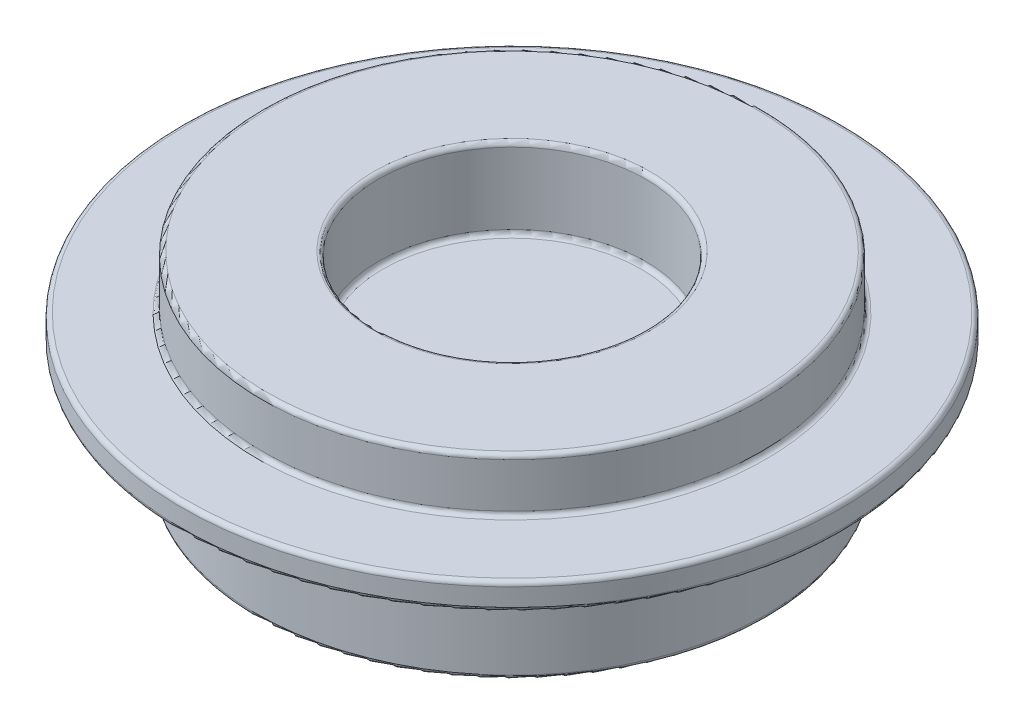
ISO-10303-21;
HEADER;
FILE_DESCRIPTION(('STEP AP214'),'2;1');
FILE_NAME('part.step','',(''),(''),'','','');
FILE_SCHEMA(('AUTOMOTIVE_DESIGN { 1 0 10303 214 1 1 1 1 }'));
ENDSEC;
DATA;
#1=APPLICATION_CONTEXT('core data for automotive mechanical design processes');
#2=APPLICATION_PROTOCOL_DEFINITION('international standard','automotive_design',2000,#1);
#3=PRODUCT_CONTEXT('',#1,'mechanical');
#4=PRODUCT('Part','Part','',(#3));
#5=PRODUCT_RELATED_PRODUCT_CATEGORY('part','',(#4));
#6=PRODUCT_DEFINITION_FORMATION('','',#4);
#7=PRODUCT_DEFINITION_CONTEXT('part definition',#1,'design');
#8=PRODUCT_DEFINITION('design','',#6,#7);
#9=PRODUCT_DEFINITION_SHAPE('','',#8);
#10=(LENGTH_UNIT() NAMED_UNIT(*) SI_UNIT(.MILLI.,.METRE.));
#11=(NAMED_UNIT(*) PLANE_ANGLE_UNIT() SI_UNIT($,.RADIAN.));
#12=(NAMED_UNIT(*) SI_UNIT($,.STERADIAN.) SOLID_ANGLE_UNIT());
#13=UNCERTAINTY_MEASURE_WITH_UNIT(LENGTH_MEASURE(1.E-05),#10,'distance_accuracy_value','');
#14=(GEOMETRIC_REPRESENTATION_CONTEXT(3) GLOBAL_UNCERTAINTY_ASSIGNED_CONTEXT((#13)) GLOBAL_UNIT_ASSIGNED_CONTEXT((#10,
#11,#12)) REPRESENTATION_CONTEXT('',''));
#15=CARTESIAN_POINT('',(0.,0.,0.));
#16=DIRECTION('',(0.,0.,1.));
#17=DIRECTION('',(1.,0.,0.));
#18=AXIS2_PLACEMENT_3D('',#15,#16,#17);
#19=CARTESIAN_POINT('',(-14.3125,0.,0.));
#20=DIRECTION('',(0.,-1.,0.));
#21=DIRECTION('',(1.,0.,0.));
#22=AXIS2_PLACEMENT_3D('',#19,#20,#21);
#23=PLANE('',#22);
#24=CARTESIAN_POINT('',(0.,0.,0.));
#25=DIRECTION('',(0.,-1.,0.));
#26=DIRECTION('',(1.,0.,0.));
#27=AXIS2_PLACEMENT_3D('',#24,#25,#26);
#28=CIRCLE('',#27,14.0625);
#29=CARTESIAN_POINT('',(14.0625,0.,0.));
#30=VERTEX_POINT('',#29);
#31=EDGE_CURVE('E10',#30,#30,#28,.T.);
#32=ORIENTED_EDGE('',*,*,#31,.T.);
#33=EDGE_LOOP('',(#32));
#34=FACE_BOUND('',#33,.T.);
#35=ADVANCED_FACE('F40',(#34),#23,.T.);
#36=CARTESIAN_POINT('',(0.,6.25,0.));
#37=DIRECTION('',(0.,1.,0.));
#38=DIRECTION('',(-1.,0.,0.));
#39=AXIS2_PLACEMENT_3D('',#36,#37,#38);
#40=PLANE('',#39);
#41=CARTESIAN_POINT('',(0.,6.25,0.));
#42=DIRECTION('',(0.,1.,0.));
#43=DIRECTION('',(-1.,0.,0.));
#44=AXIS2_PLACEMENT_3D('',#41,#42,#43);
#45=CIRCLE('',#44,7.25);
#46=CARTESIAN_POINT('',(-7.25,6.25,0.));
#47=VERTEX_POINT('',#46);
#48=EDGE_CURVE('E84',#47,#47,#45,.T.);
#49=ORIENTED_EDGE('',*,*,#48,.T.);
#50=EDGE_LOOP('',(#49));
#51=FACE_BOUND('',#50,.T.);
#52=ADVANCED_FACE('F137',(#51),#40,.T.);
#53=CARTESIAN_POINT('',(0.,17.96875,0.));
#54=DIRECTION('',(0.,1.,0.));
#55=DIRECTION('',(-1.,0.,0.));
#56=AXIS2_PLACEMENT_3D('',#53,#54,#55);
#57=CYLINDRICAL_SURFACE('',#56,7.5);
#58=CARTESIAN_POINT('',(0.,6.5,0.));
#59=DIRECTION('',(0.,1.,0.));
#60=DIRECTION('',(-1.,0.,0.));
#61=AXIS2_PLACEMENT_3D('',#58,#59,#60);
#62=CIRCLE('',#61,7.5);
#63=CARTESIAN_POINT('',(-7.5,6.5,0.));
#64=VERTEX_POINT('',#63);
#65=EDGE_CURVE('E76',#64,#64,#62,.F.);
#66=ORIENTED_EDGE('',*,*,#65,.T.);
#67=EDGE_LOOP('',(#66));
#68=FACE_BOUND('',#67,.T.);
#69=CARTESIAN_POINT('',(0.,10.5,0.));
#70=DIRECTION('',(0.,1.,0.));
#71=DIRECTION('',(-1.,0.,0.));
#72=AXIS2_PLACEMENT_3D('',#69,#70,#71);
#73=CIRCLE('',#72,7.5);
#74=CARTESIAN_POINT('',(-7.5,10.5,0.));
#75=VERTEX_POINT('',#74);
#76=EDGE_CURVE('E80',#75,#75,#73,.T.);
#77=ORIENTED_EDGE('',*,*,#76,.T.);
#78=EDGE_LOOP('',(#77));
#79=FACE_BOUND('',#78,.T.);
#80=ADVANCED_FACE('F133',(#68,#79),#57,.F.);
#81=CARTESIAN_POINT('',(-7.5,10.75,0.));
#82=DIRECTION('',(0.,1.,0.));
#83=DIRECTION('',(-1.,0.,0.));
#84=AXIS2_PLACEMENT_3D('',#81,#82,#83);
#85=PLANE('',#84);
#86=CARTESIAN_POINT('',(0.,10.75,0.));
#87=DIRECTION('',(0.,1.,0.));
#88=DIRECTION('',(-1.,0.,0.));
#89=AXIS2_PLACEMENT_3D('',#86,#87,#88);
#90=CIRCLE('',#89,7.75);
#91=CARTESIAN_POINT('',(-7.75,10.75,0.));
#92=VERTEX_POINT('',#91);
#93=EDGE_CURVE('E68',#92,#92,#90,.F.);
#94=ORIENTED_EDGE('',*,*,#93,.T.);
#95=EDGE_LOOP('',(#94));
#96=FACE_BOUND('',#95,.T.);
#97=CARTESIAN_POINT('',(0.,10.75,0.));
#98=DIRECTION('',(0.,1.,0.));
#99=DIRECTION('',(-1.,0.,0.));
#100=AXIS2_PLACEMENT_3D('',#97,#98,#99);
#101=CIRCLE('',#100,13.75);
#102=CARTESIAN_POINT('',(-13.75,10.75,0.));
#103=VERTEX_POINT('',#102);
#104=EDGE_CURVE('E72',#103,#103,#101,.T.);
#105=ORIENTED_EDGE('',*,*,#104,.T.);
#106=EDGE_LOOP('',(#105));
#107=FACE_BOUND('',#106,.T.);
#108=ADVANCED_FACE('F123',(#96,#107),#85,.T.);
#109=CARTESIAN_POINT('',(0.,17.96875,0.));
#110=DIRECTION('',(0.,1.,0.));
#111=DIRECTION('',(-1.,0.,0.));
#112=AXIS2_PLACEMENT_3D('',#109,#110,#111);
#113=CYLINDRICAL_SURFACE('',#112,14.);
#114=CARTESIAN_POINT('',(0.,10.5,0.));
#115=DIRECTION('',(0.,1.,0.));
#116=DIRECTION('',(-1.,0.,0.));
#117=AXIS2_PLACEMENT_3D('',#114,#115,#116);
#118=CIRCLE('',#117,14.);
#119=CARTESIAN_POINT('',(-14.,10.5,0.));
#120=VERTEX_POINT('',#119);
#121=EDGE_CURVE('E58',#120,#120,#118,.F.);
#122=ORIENTED_EDGE('',*,*,#121,.T.);
#123=EDGE_LOOP('',(#122));
#124=FACE_BOUND('',#123,.T.);
#125=CARTESIAN_POINT('',(0.,8.00000000000001,0.));
#126=DIRECTION('',(0.,1.,0.));
#127=DIRECTION('',(-1.,0.,0.));
#128=AXIS2_PLACEMENT_3D('',#125,#126,#127);
#129=CIRCLE('',#128,14.);
#130=CARTESIAN_POINT('',(-14.,8.,0.));
#131=VERTEX_POINT('',#130);
#132=EDGE_CURVE('E64',#131,#131,#129,.T.);
#133=ORIENTED_EDGE('',*,*,#132,.T.);
#134=EDGE_LOOP('',(#133));
#135=FACE_BOUND('',#134,.T.);
#136=ADVANCED_FACE('F121',(#124,#135),#113,.T.);
#137=CARTESIAN_POINT('',(-14.,7.75,0.));
#138=DIRECTION('',(0.,1.,0.));
#139=DIRECTION('',(-1.,0.,0.));
#140=AXIS2_PLACEMENT_3D('',#137,#138,#139);
#141=PLANE('',#140);
#142=CARTESIAN_POINT('',(0.,7.75000000000001,0.));
#143=DIRECTION('',(0.,1.,0.));
#144=DIRECTION('',(-1.,0.,0.));
#145=AXIS2_PLACEMENT_3D('',#142,#143,#144);
#146=CIRCLE('',#145,18.25);
#147=CARTESIAN_POINT('',(-18.25,7.75,0.));
#148=VERTEX_POINT('',#147);
#149=EDGE_CURVE('E104',#148,#148,#146,.T.);
#150=ORIENTED_EDGE('',*,*,#149,.T.);
#151=EDGE_LOOP('',(#150));
#152=FACE_BOUND('',#151,.T.);
#153=CARTESIAN_POINT('',(0.,7.75000000000001,0.));
#154=DIRECTION('',(0.,1.,0.));
#155=DIRECTION('',(-1.,0.,0.));
#156=AXIS2_PLACEMENT_3D('',#153,#154,#155);
#157=CIRCLE('',#156,14.25);
#158=CARTESIAN_POINT('',(-14.25,7.75,0.));
#159=VERTEX_POINT('',#158);
#160=EDGE_CURVE('E108',#159,#159,#157,.F.);
#161=ORIENTED_EDGE('',*,*,#160,.T.);
#162=EDGE_LOOP('',(#161));
#163=FACE_BOUND('',#162,.T.);
#164=ADVANCED_FACE('F113',(#152,#163),#141,.T.);
#165=CARTESIAN_POINT('',(0.,17.96875,0.));
#166=DIRECTION('',(0.,1.,0.));
#167=DIRECTION('',(-1.,0.,0.));
#168=AXIS2_PLACEMENT_3D('',#165,#166,#167);
#169=CYLINDRICAL_SURFACE('',#168,18.5);
#170=CARTESIAN_POINT('',(0.,7.50000000000001,0.));
#171=DIRECTION('',(0.,1.,0.));
#172=DIRECTION('',(-1.,0.,0.));
#173=AXIS2_PLACEMENT_3D('',#170,#171,#172);
#174=CIRCLE('',#173,18.5);
#175=CARTESIAN_POINT('',(-18.5,7.5,0.));
#176=VERTEX_POINT('',#175);
#177=EDGE_CURVE('E96',#176,#176,#174,.F.);
#178=ORIENTED_EDGE('',*,*,#177,.T.);
#179=EDGE_LOOP('',(#178));
#180=FACE_BOUND('',#179,.T.);
#181=CARTESIAN_POINT('',(0.,6.5,0.));
#182=DIRECTION('',(0.,-1.,0.));
#183=DIRECTION('',(1.,0.,0.));
#184=AXIS2_PLACEMENT_3D('',#181,#182,#183);
#185=CIRCLE('',#184,18.5);
#186=CARTESIAN_POINT('',(18.5,6.50000000000001,0.));
#187=VERTEX_POINT('',#186);
#188=EDGE_CURVE('E100',#187,#187,#185,.F.);
#189=ORIENTED_EDGE('',*,*,#188,.T.);
#190=EDGE_LOOP('',(#189));
#191=FACE_BOUND('',#190,.T.);
#192=ADVANCED_FACE('F130',(#180,#191),#169,.T.);
#193=CARTESIAN_POINT('',(-18.5,6.25,0.));
#194=DIRECTION('',(0.,-1.,0.));
#195=DIRECTION('',(1.,0.,0.));
#196=AXIS2_PLACEMENT_3D('',#193,#194,#195);
#197=PLANE('',#196);
#198=CARTESIAN_POINT('',(0.,6.25000000000001,0.));
#199=DIRECTION('',(0.,-1.,0.));
#200=DIRECTION('',(1.,0.,0.));
#201=AXIS2_PLACEMENT_3D('',#198,#199,#200);
#202=CIRCLE('',#201,18.25);
#203=CARTESIAN_POINT('',(18.25,6.25000000000001,0.));
#204=VERTEX_POINT('',#203);
#205=EDGE_CURVE('E88',#204,#204,#202,.T.);
#206=ORIENTED_EDGE('',*,*,#205,.T.);
#207=EDGE_LOOP('',(#206));
#208=FACE_BOUND('',#207,.T.);
#209=CARTESIAN_POINT('',(0.,6.25000000000001,0.));
#210=DIRECTION('',(0.,-1.,0.));
#211=DIRECTION('',(1.,0.,0.));
#212=AXIS2_PLACEMENT_3D('',#209,#210,#211);
#213=CIRCLE('',#212,14.5625);
#214=CARTESIAN_POINT('',(14.5625,6.25000000000001,0.));
#215=VERTEX_POINT('',#214);
#216=EDGE_CURVE('E92',#215,#215,#213,.F.);
#217=ORIENTED_EDGE('',*,*,#216,.T.);
#218=EDGE_LOOP('',(#217));
#219=FACE_BOUND('',#218,.T.);
#220=ADVANCED_FACE('F174',(#208,#219),#197,.T.);
#221=CARTESIAN_POINT('',(0.,17.96875,0.));
#222=DIRECTION('',(0.,1.,0.));
#223=DIRECTION('',(-1.,0.,0.));
#224=AXIS2_PLACEMENT_3D('',#221,#222,#223);
#225=CYLINDRICAL_SURFACE('',#224,14.3125);
#226=CARTESIAN_POINT('',(0.,6.,0.));
#227=DIRECTION('',(0.,-1.,0.));
#228=DIRECTION('',(1.,0.,0.));
#229=AXIS2_PLACEMENT_3D('',#226,#227,#228);
#230=CIRCLE('',#229,14.3125);
#231=CARTESIAN_POINT('',(14.3125,6.00000000000001,0.));
#232=VERTEX_POINT('',#231);
#233=EDGE_CURVE('E48',#232,#232,#230,.T.);
#234=ORIENTED_EDGE('',*,*,#233,.T.);
#235=EDGE_LOOP('',(#234));
#236=FACE_BOUND('',#235,.T.);
#237=CARTESIAN_POINT('',(0.,0.25,0.));
#238=DIRECTION('',(0.,-1.,0.));
#239=DIRECTION('',(1.,0.,0.));
#240=AXIS2_PLACEMENT_3D('',#237,#238,#239);
#241=CIRCLE('',#240,14.3125);
#242=CARTESIAN_POINT('',(14.3125,0.250000000000005,0.));
#243=VERTEX_POINT('',#242);
#244=EDGE_CURVE('E53',#243,#243,#241,.F.);
#245=ORIENTED_EDGE('',*,*,#244,.T.);
#246=EDGE_LOOP('',(#245));
#247=FACE_BOUND('',#246,.T.);
#248=ADVANCED_FACE('F150',(#236,#247),#225,.T.);
#249=CARTESIAN_POINT('',(0.,7.50000000000001,0.));
#250=DIRECTION('',(0.,1.,0.));
#251=DIRECTION('',(-1.,0.,0.));
#252=AXIS2_PLACEMENT_3D('',#249,#250,#251);
#253=TOROIDAL_SURFACE('',#252,18.25,0.25);
#254=ORIENTED_EDGE('',*,*,#177,.F.);
#255=EDGE_LOOP('',(#254));
#256=FACE_BOUND('',#255,.T.);
#257=ORIENTED_EDGE('',*,*,#149,.F.);
#258=EDGE_LOOP('',(#257));
#259=FACE_BOUND('',#258,.T.);
#260=ADVANCED_FACE('F146',(#256,#259),#253,.T.);
#261=CARTESIAN_POINT('',(0.,6.5,0.));
#262=DIRECTION('',(0.,-1.,0.));
#263=DIRECTION('',(1.,0.,0.));
#264=AXIS2_PLACEMENT_3D('',#261,#262,#263);
#265=TOROIDAL_SURFACE('',#264,18.25,0.25);
#266=ORIENTED_EDGE('',*,*,#205,.F.);
#267=EDGE_LOOP('',(#266));
#268=FACE_BOUND('',#267,.T.);
#269=ORIENTED_EDGE('',*,*,#188,.F.);
#270=EDGE_LOOP('',(#269));
#271=FACE_BOUND('',#270,.T.);
#272=ADVANCED_FACE('F149',(#268,#271),#265,.T.);
#273=CARTESIAN_POINT('',(0.,6.5,0.));
#274=DIRECTION('',(0.,1.,0.));
#275=DIRECTION('',(-1.,0.,0.));
#276=AXIS2_PLACEMENT_3D('',#273,#274,#275);
#277=TOROIDAL_SURFACE('',#276,7.25,0.25);
#278=ORIENTED_EDGE('',*,*,#65,.F.);
#279=EDGE_LOOP('',(#278));
#280=FACE_BOUND('',#279,.T.);
#281=ORIENTED_EDGE('',*,*,#48,.F.);
#282=EDGE_LOOP('',(#281));
#283=FACE_BOUND('',#282,.T.);
#284=ADVANCED_FACE('F154',(#280,#283),#277,.F.);
#285=CARTESIAN_POINT('',(0.,10.5,0.));
#286=DIRECTION('',(0.,1.,0.));
#287=DIRECTION('',(-1.,0.,0.));
#288=AXIS2_PLACEMENT_3D('',#285,#286,#287);
#289=TOROIDAL_SURFACE('',#288,7.75,0.25);
#290=ORIENTED_EDGE('',*,*,#93,.F.);
#291=EDGE_LOOP('',(#290));
#292=FACE_BOUND('',#291,.T.);
#293=ORIENTED_EDGE('',*,*,#76,.F.);
#294=EDGE_LOOP('',(#293));
#295=FACE_BOUND('',#294,.T.);
#296=ADVANCED_FACE('F158',(#292,#295),#289,.T.);
#297=CARTESIAN_POINT('',(0.,10.5,0.));
#298=DIRECTION('',(0.,1.,0.));
#299=DIRECTION('',(-1.,0.,0.));
#300=AXIS2_PLACEMENT_3D('',#297,#298,#299);
#301=TOROIDAL_SURFACE('',#300,13.75,0.25);
#302=ORIENTED_EDGE('',*,*,#121,.F.);
#303=EDGE_LOOP('',(#302));
#304=FACE_BOUND('',#303,.T.);
#305=ORIENTED_EDGE('',*,*,#104,.F.);
#306=EDGE_LOOP('',(#305));
#307=FACE_BOUND('',#306,.T.);
#308=ADVANCED_FACE('F162',(#304,#307),#301,.T.);
#309=CARTESIAN_POINT('',(0.,6.,0.));
#310=DIRECTION('',(0.,-1.,0.));
#311=DIRECTION('',(1.,0.,0.));
#312=AXIS2_PLACEMENT_3D('',#309,#310,#311);
#313=TOROIDAL_SURFACE('',#312,14.5625,0.25);
#314=ORIENTED_EDGE('',*,*,#233,.F.);
#315=EDGE_LOOP('',(#314));
#316=FACE_BOUND('',#315,.T.);
#317=ORIENTED_EDGE('',*,*,#216,.F.);
#318=EDGE_LOOP('',(#317));
#319=FACE_BOUND('',#318,.T.);
#320=ADVANCED_FACE('F118',(#316,#319),#313,.F.);
#321=CARTESIAN_POINT('',(0.,8.00000000000001,0.));
#322=DIRECTION('',(0.,1.,0.));
#323=DIRECTION('',(-1.,0.,0.));
#324=AXIS2_PLACEMENT_3D('',#321,#322,#323);
#325=TOROIDAL_SURFACE('',#324,14.25,0.25);
#326=ORIENTED_EDGE('',*,*,#160,.F.);
#327=EDGE_LOOP('',(#326));
#328=FACE_BOUND('',#327,.T.);
#329=ORIENTED_EDGE('',*,*,#132,.F.);
#330=EDGE_LOOP('',(#329));
#331=FACE_BOUND('',#330,.T.);
#332=ADVANCED_FACE('F115',(#328,#331),#325,.F.);
#333=CARTESIAN_POINT('',(0.,0.25,0.));
#334=DIRECTION('',(0.,-1.,0.));
#335=DIRECTION('',(1.,0.,0.));
#336=AXIS2_PLACEMENT_3D('',#333,#334,#335);
#337=TOROIDAL_SURFACE('',#336,14.0625,0.25);
#338=ORIENTED_EDGE('',*,*,#31,.F.);
#339=EDGE_LOOP('',(#338));
#340=FACE_BOUND('',#339,.T.);
#341=ORIENTED_EDGE('',*,*,#244,.F.);
#342=EDGE_LOOP('',(#341));
#343=FACE_BOUND('',#342,.T.);
#344=ADVANCED_FACE('F42',(#340,#343),#337,.T.);
#345=CLOSED_SHELL('',(#35,#52,#80,#108,#136,#164,#192,#220,#248,#260,#272,#284,#296,#308,#320,
#332,#344));
#346=MANIFOLD_SOLID_BREP('B2',#345);
#347=ADVANCED_BREP_SHAPE_REPRESENTATION('',(#18,#346),#14);
#348=SHAPE_DEFINITION_REPRESENTATION(#9,#347);
ENDSEC;
END-ISO-10303-21;
